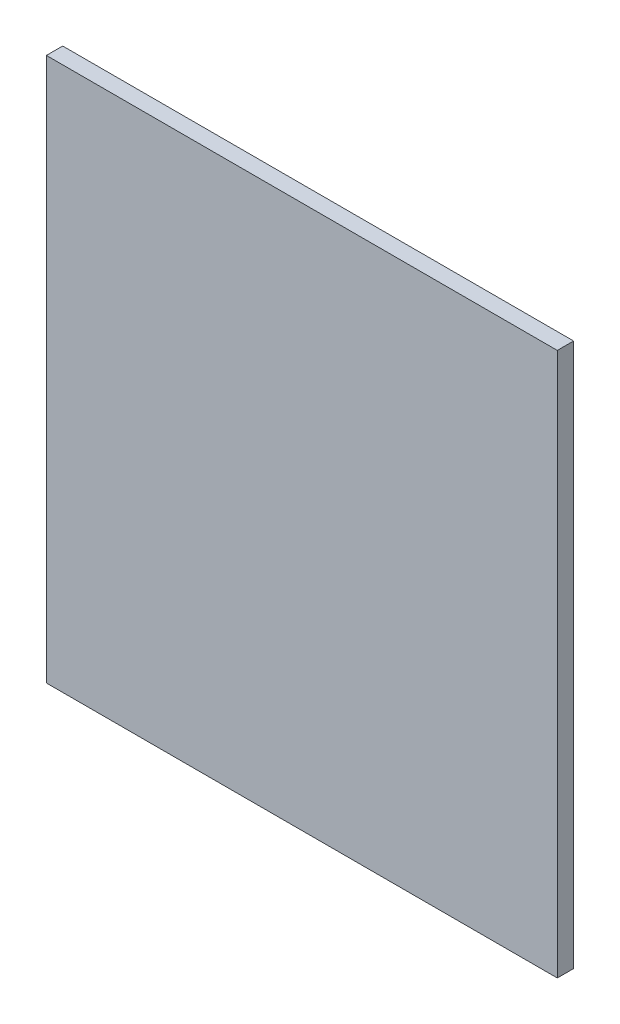
ISO-10303-21;
HEADER;
FILE_DESCRIPTION(('STEP AP214'),'2;1');
FILE_NAME('part.step','',(''),(''),'','','');
FILE_SCHEMA(('AUTOMOTIVE_DESIGN { 1 0 10303 214 1 1 1 1 }'));
ENDSEC;
DATA;
#1=APPLICATION_CONTEXT('core data for automotive mechanical design processes');
#2=APPLICATION_PROTOCOL_DEFINITION('international standard','automotive_design',2000,#1);
#3=PRODUCT_CONTEXT('',#1,'mechanical');
#4=PRODUCT('Part','Part','',(#3));
#5=PRODUCT_RELATED_PRODUCT_CATEGORY('part','',(#4));
#6=PRODUCT_DEFINITION_FORMATION('','',#4);
#7=PRODUCT_DEFINITION_CONTEXT('part definition',#1,'design');
#8=PRODUCT_DEFINITION('design','',#6,#7);
#9=PRODUCT_DEFINITION_SHAPE('','',#8);
#10=(LENGTH_UNIT() NAMED_UNIT(*) SI_UNIT(.MILLI.,.METRE.));
#11=(NAMED_UNIT(*) PLANE_ANGLE_UNIT() SI_UNIT($,.RADIAN.));
#12=(NAMED_UNIT(*) SI_UNIT($,.STERADIAN.) SOLID_ANGLE_UNIT());
#13=UNCERTAINTY_MEASURE_WITH_UNIT(LENGTH_MEASURE(1.E-05),#10,'distance_accuracy_value','');
#14=(GEOMETRIC_REPRESENTATION_CONTEXT(3) GLOBAL_UNCERTAINTY_ASSIGNED_CONTEXT((#13)) GLOBAL_UNIT_ASSIGNED_CONTEXT((#10,
#11,#12)) REPRESENTATION_CONTEXT('',''));
#15=CARTESIAN_POINT('',(0.,0.,0.));
#16=DIRECTION('',(0.,0.,1.));
#17=DIRECTION('',(1.,0.,0.));
#18=AXIS2_PLACEMENT_3D('',#15,#16,#17);
#19=CARTESIAN_POINT('',(-282.,-300.,18.));
#20=DIRECTION('',(1.,0.,0.));
#21=DIRECTION('',(0.,0.,-1.));
#22=AXIS2_PLACEMENT_3D('',#19,#20,#21);
#23=PLANE('',#22);
#24=DIRECTION('',(0.,-1.,0.));
#25=VECTOR('',#24,1.);
#26=CARTESIAN_POINT('',(-282.,-300.,0.));
#27=LINE('',#26,#25);
#28=CARTESIAN_POINT('',(-282.,300.,0.));
#29=VERTEX_POINT('',#28);
#30=CARTESIAN_POINT('',(-282.,-300.,0.));
#31=VERTEX_POINT('',#30);
#32=EDGE_CURVE('E96',#29,#31,#27,.T.);
#33=ORIENTED_EDGE('',*,*,#32,.T.);
#34=DIRECTION('',(0.,0.,-1.));
#35=VECTOR('',#34,1.);
#36=CARTESIAN_POINT('',(-282.,-300.,18.));
#37=LINE('',#36,#35);
#38=CARTESIAN_POINT('',(-282.,-300.,18.));
#39=VERTEX_POINT('',#38);
#40=EDGE_CURVE('E11',#39,#31,#37,.T.);
#41=ORIENTED_EDGE('',*,*,#40,.F.);
#42=DIRECTION('',(0.,-1.,0.));
#43=VECTOR('',#42,1.);
#44=CARTESIAN_POINT('',(-282.,-300.,18.));
#45=LINE('',#44,#43);
#46=CARTESIAN_POINT('',(-282.,300.,18.));
#47=VERTEX_POINT('',#46);
#48=EDGE_CURVE('E84',#47,#39,#45,.T.);
#49=ORIENTED_EDGE('',*,*,#48,.F.);
#50=DIRECTION('',(0.,0.,-1.));
#51=VECTOR('',#50,1.);
#52=CARTESIAN_POINT('',(-282.,300.,18.));
#53=LINE('',#52,#51);
#54=EDGE_CURVE('E92',#47,#29,#53,.T.);
#55=ORIENTED_EDGE('',*,*,#54,.T.);
#56=EDGE_LOOP('',(#33,#41,#49,#55));
#57=FACE_BOUND('',#56,.T.);
#58=ADVANCED_FACE('F33',(#57),#23,.F.);
#59=CARTESIAN_POINT('',(282.,-300.,18.));
#60=DIRECTION('',(0.,1.,0.));
#61=DIRECTION('',(-1.,0.,0.));
#62=AXIS2_PLACEMENT_3D('',#59,#60,#61);
#63=PLANE('',#62);
#64=DIRECTION('',(1.,0.,0.));
#65=VECTOR('',#64,1.);
#66=CARTESIAN_POINT('',(282.,-300.,0.));
#67=LINE('',#66,#65);
#68=CARTESIAN_POINT('',(282.,-300.,0.));
#69=VERTEX_POINT('',#68);
#70=EDGE_CURVE('E88',#31,#69,#67,.T.);
#71=ORIENTED_EDGE('',*,*,#70,.T.);
#72=DIRECTION('',(0.,0.,-1.));
#73=VECTOR('',#72,1.);
#74=CARTESIAN_POINT('',(282.,-300.,18.));
#75=LINE('',#74,#73);
#76=CARTESIAN_POINT('',(282.,-300.,18.));
#77=VERTEX_POINT('',#76);
#78=EDGE_CURVE('E41',#77,#69,#75,.T.);
#79=ORIENTED_EDGE('',*,*,#78,.F.);
#80=DIRECTION('',(1.,0.,0.));
#81=VECTOR('',#80,1.);
#82=CARTESIAN_POINT('',(282.,-300.,18.));
#83=LINE('',#82,#81);
#84=EDGE_CURVE('E79',#39,#77,#83,.T.);
#85=ORIENTED_EDGE('',*,*,#84,.F.);
#86=ORIENTED_EDGE('',*,*,#40,.T.);
#87=EDGE_LOOP('',(#71,#79,#85,#86));
#88=FACE_BOUND('',#87,.T.);
#89=ADVANCED_FACE('F87',(#88),#63,.F.);
#90=CARTESIAN_POINT('',(282.,-300.,18.));
#91=DIRECTION('',(-1.,0.,0.));
#92=DIRECTION('',(0.,0.,1.));
#93=AXIS2_PLACEMENT_3D('',#90,#91,#92);
#94=PLANE('',#93);
#95=DIRECTION('',(0.,1.,0.));
#96=VECTOR('',#95,1.);
#97=CARTESIAN_POINT('',(282.,-300.,0.));
#98=LINE('',#97,#96);
#99=CARTESIAN_POINT('',(282.,300.,0.));
#100=VERTEX_POINT('',#99);
#101=EDGE_CURVE('E66',#69,#100,#98,.T.);
#102=ORIENTED_EDGE('',*,*,#101,.T.);
#103=DIRECTION('',(0.,0.,-1.));
#104=VECTOR('',#103,1.);
#105=CARTESIAN_POINT('',(282.,300.,18.));
#106=LINE('',#105,#104);
#107=CARTESIAN_POINT('',(282.,300.,18.));
#108=VERTEX_POINT('',#107);
#109=EDGE_CURVE('E89',#108,#100,#106,.T.);
#110=ORIENTED_EDGE('',*,*,#109,.F.);
#111=DIRECTION('',(0.,1.,0.));
#112=VECTOR('',#111,1.);
#113=CARTESIAN_POINT('',(282.,-300.,18.));
#114=LINE('',#113,#112);
#115=EDGE_CURVE('E82',#77,#108,#114,.T.);
#116=ORIENTED_EDGE('',*,*,#115,.F.);
#117=ORIENTED_EDGE('',*,*,#78,.T.);
#118=EDGE_LOOP('',(#102,#110,#116,#117));
#119=FACE_BOUND('',#118,.T.);
#120=ADVANCED_FACE('F90',(#119),#94,.F.);
#121=CARTESIAN_POINT('',(282.,300.,18.));
#122=DIRECTION('',(0.,-1.,0.));
#123=DIRECTION('',(1.,0.,0.));
#124=AXIS2_PLACEMENT_3D('',#121,#122,#123);
#125=PLANE('',#124);
#126=DIRECTION('',(-1.,0.,0.));
#127=VECTOR('',#126,1.);
#128=CARTESIAN_POINT('',(282.,300.,0.));
#129=LINE('',#128,#127);
#130=EDGE_CURVE('E72',#100,#29,#129,.T.);
#131=ORIENTED_EDGE('',*,*,#130,.T.);
#132=ORIENTED_EDGE('',*,*,#54,.F.);
#133=DIRECTION('',(-1.,0.,0.));
#134=VECTOR('',#133,1.);
#135=CARTESIAN_POINT('',(282.,300.,18.));
#136=LINE('',#135,#134);
#137=EDGE_CURVE('E49',#108,#47,#136,.T.);
#138=ORIENTED_EDGE('',*,*,#137,.F.);
#139=ORIENTED_EDGE('',*,*,#109,.T.);
#140=EDGE_LOOP('',(#131,#132,#138,#139));
#141=FACE_BOUND('',#140,.T.);
#142=ADVANCED_FACE('F103',(#141),#125,.F.);
#143=CARTESIAN_POINT('',(0.,0.,18.));
#144=DIRECTION('',(0.,0.,1.));
#145=DIRECTION('',(1.,0.,0.));
#146=AXIS2_PLACEMENT_3D('',#143,#144,#145);
#147=PLANE('',#146);
#148=ORIENTED_EDGE('',*,*,#48,.T.);
#149=ORIENTED_EDGE('',*,*,#84,.T.);
#150=ORIENTED_EDGE('',*,*,#115,.T.);
#151=ORIENTED_EDGE('',*,*,#137,.T.);
#152=EDGE_LOOP('',(#148,#149,#150,#151));
#153=FACE_BOUND('',#152,.T.);
#154=ADVANCED_FACE('F80',(#153),#147,.T.);
#155=CARTESIAN_POINT('',(0.,0.,0.));
#156=DIRECTION('',(0.,0.,1.));
#157=DIRECTION('',(1.,0.,0.));
#158=AXIS2_PLACEMENT_3D('',#155,#156,#157);
#159=PLANE('',#158);
#160=ORIENTED_EDGE('',*,*,#32,.F.);
#161=ORIENTED_EDGE('',*,*,#130,.F.);
#162=ORIENTED_EDGE('',*,*,#101,.F.);
#163=ORIENTED_EDGE('',*,*,#70,.F.);
#164=EDGE_LOOP('',(#160,#161,#162,#163));
#165=FACE_BOUND('',#164,.T.);
#166=ADVANCED_FACE('F106',(#165),#159,.F.);
#167=CLOSED_SHELL('',(#58,#89,#120,#142,#154,#166));
#168=MANIFOLD_SOLID_BREP('B2',#167);
#169=ADVANCED_BREP_SHAPE_REPRESENTATION('',(#18,#168),#14);
#170=SHAPE_DEFINITION_REPRESENTATION(#9,#169);
ENDSEC;
END-ISO-10303-21;
